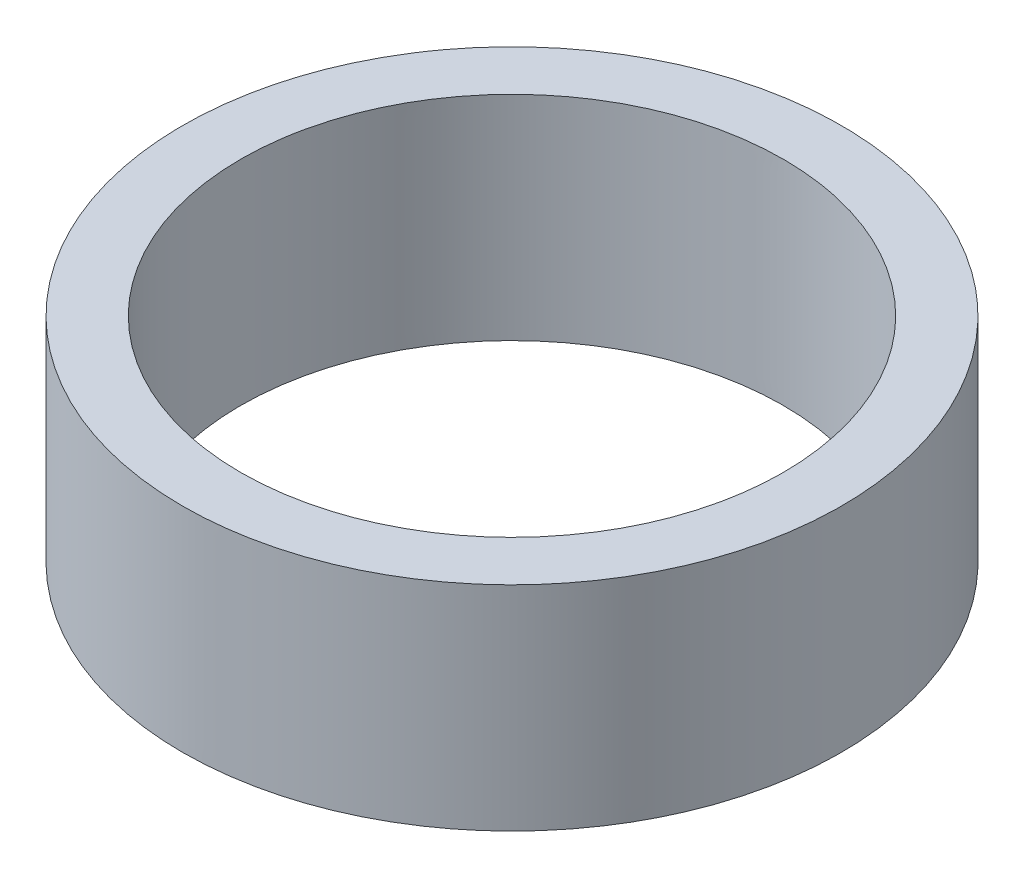
ISO-10303-21;
HEADER;
FILE_DESCRIPTION(('STEP AP214'),'2;1');
FILE_NAME('part.step','',(''),(''),'','','');
FILE_SCHEMA(('AUTOMOTIVE_DESIGN { 1 0 10303 214 1 1 1 1 }'));
ENDSEC;
DATA;
#1=APPLICATION_CONTEXT('core data for automotive mechanical design processes');
#2=APPLICATION_PROTOCOL_DEFINITION('international standard','automotive_design',2000,#1);
#3=PRODUCT_CONTEXT('',#1,'mechanical');
#4=PRODUCT('Part','Part','',(#3));
#5=PRODUCT_RELATED_PRODUCT_CATEGORY('part','',(#4));
#6=PRODUCT_DEFINITION_FORMATION('','',#4);
#7=PRODUCT_DEFINITION_CONTEXT('part definition',#1,'design');
#8=PRODUCT_DEFINITION('design','',#6,#7);
#9=PRODUCT_DEFINITION_SHAPE('','',#8);
#10=(LENGTH_UNIT() NAMED_UNIT(*) SI_UNIT(.MILLI.,.METRE.));
#11=(NAMED_UNIT(*) PLANE_ANGLE_UNIT() SI_UNIT($,.RADIAN.));
#12=(NAMED_UNIT(*) SI_UNIT($,.STERADIAN.) SOLID_ANGLE_UNIT());
#13=UNCERTAINTY_MEASURE_WITH_UNIT(LENGTH_MEASURE(1.E-05),#10,'distance_accuracy_value','');
#14=(GEOMETRIC_REPRESENTATION_CONTEXT(3) GLOBAL_UNCERTAINTY_ASSIGNED_CONTEXT((#13)) GLOBAL_UNIT_ASSIGNED_CONTEXT((#10,
#11,#12)) REPRESENTATION_CONTEXT('',''));
#15=CARTESIAN_POINT('',(0.,0.,0.));
#16=DIRECTION('',(0.,0.,1.));
#17=DIRECTION('',(1.,0.,0.));
#18=AXIS2_PLACEMENT_3D('',#15,#16,#17);
#19=CARTESIAN_POINT('',(0.,-2.7666312331574,0.846715728752538));
#20=CARTESIAN_POINT('',(-0.11081991501826,-2.7666312331574,0.846715728752538));
#21=CARTESIAN_POINT('',(-0.332459745054779,-2.7666312331574,0.802628825454349));
#22=CARTESIAN_POINT('',(-0.614305507680061,-2.7666312331574,0.614305507680062));
#23=CARTESIAN_POINT('',(-0.802628825454349,-2.7666312331574,0.332459745054779));
#24=CARTESIAN_POINT('',(-0.868759180401632,-2.7666312331574,0.));
#25=CARTESIAN_POINT('',(-0.802628825454349,-2.7666312331574,-0.332459745054779));
#26=CARTESIAN_POINT('',(-0.614305507680062,-2.7666312331574,-0.614305507680062));
#27=CARTESIAN_POINT('',(-0.332459745054779,-2.7666312331574,-0.802628825454349));
#28=CARTESIAN_POINT('',(0.,-2.7666312331574,-0.868759180401632));
#29=CARTESIAN_POINT('',(0.332459745054779,-2.7666312331574,-0.802628825454349));
#30=CARTESIAN_POINT('',(0.614305507680063,-2.7666312331574,-0.614305507680062));
#31=CARTESIAN_POINT('',(0.802628825454349,-2.7666312331574,-0.33245974505478));
#32=CARTESIAN_POINT('',(0.868759180401633,-2.7666312331574,0.));
#33=CARTESIAN_POINT('',(0.802628825454349,-2.7666312331574,0.332459745054779));
#34=CARTESIAN_POINT('',(0.614305507680062,-2.7666312331574,0.614305507680061));
#35=CARTESIAN_POINT('',(0.332459745054779,-2.7666312331574,0.802628825454349));
#36=CARTESIAN_POINT('',(0.11081991501826,-2.7666312331574,0.846715728752538));
#37=CARTESIAN_POINT('',(0.,-2.7666312331574,0.846715728752538));
#38=B_SPLINE_CURVE_WITH_KNOTS('',3,(#19,#20,#21,#22,#23,#24,#25,#26,#27,#28,#29,#30,#31,#32,#33,
#34,#35,#36,#37),.UNSPECIFIED.,.T.,.F.,(4,1,1,1,1,1,1,1,1,1,1,1,1,1,1,1,4),(0.,0.0625,0.125,
0.1875,0.25,0.3125,0.375,0.4375,0.5,0.5625,0.625,0.6875,0.75,0.8125,0.875,0.9375,1.),.UNSPECIFIED.);
#39=DIRECTION('',(0.,1.,0.));
#40=VECTOR('',#39,1.);
#41=SURFACE_OF_LINEAR_EXTRUSION('',#38,#40);
#42=CARTESIAN_POINT('',(0.,-2.7666312331574,0.846715728752538));
#43=CARTESIAN_POINT('',(-0.11081991501826,-2.7666312331574,0.846715728752538));
#44=CARTESIAN_POINT('',(-0.332459745054779,-2.7666312331574,0.802628825454349));
#45=CARTESIAN_POINT('',(-0.614305507680061,-2.7666312331574,0.614305507680062));
#46=CARTESIAN_POINT('',(-0.802628825454349,-2.7666312331574,0.332459745054779));
#47=CARTESIAN_POINT('',(-0.868759180401632,-2.7666312331574,0.));
#48=CARTESIAN_POINT('',(-0.802628825454349,-2.7666312331574,-0.332459745054779));
#49=CARTESIAN_POINT('',(-0.614305507680062,-2.7666312331574,-0.614305507680062));
#50=CARTESIAN_POINT('',(-0.332459745054779,-2.7666312331574,-0.802628825454349));
#51=CARTESIAN_POINT('',(0.,-2.7666312331574,-0.868759180401632));
#52=CARTESIAN_POINT('',(0.332459745054779,-2.7666312331574,-0.802628825454349));
#53=CARTESIAN_POINT('',(0.614305507680063,-2.7666312331574,-0.614305507680062));
#54=CARTESIAN_POINT('',(0.802628825454349,-2.7666312331574,-0.33245974505478));
#55=CARTESIAN_POINT('',(0.868759180401633,-2.7666312331574,0.));
#56=CARTESIAN_POINT('',(0.802628825454349,-2.7666312331574,0.332459745054779));
#57=CARTESIAN_POINT('',(0.614305507680062,-2.7666312331574,0.614305507680061));
#58=CARTESIAN_POINT('',(0.332459745054779,-2.7666312331574,0.802628825454349));
#59=CARTESIAN_POINT('',(0.11081991501826,-2.7666312331574,0.846715728752538));
#60=CARTESIAN_POINT('',(0.,-2.7666312331574,0.846715728752538));
#61=B_SPLINE_CURVE_WITH_KNOTS('',3,(#42,#43,#44,#45,#46,#47,#48,#49,#50,#51,#52,#53,#54,#55,#56,
#57,#58,#59,#60),.UNSPECIFIED.,.T.,.F.,(4,1,1,1,1,1,1,1,1,1,1,1,1,1,1,1,4),(0.,0.0625,0.125,
0.1875,0.25,0.3125,0.375,0.4375,0.5,0.5625,0.625,0.6875,0.75,0.8125,0.875,0.9375,1.),.UNSPECIFIED.);
#62=CARTESIAN_POINT('',(0.,-2.7666312331574,0.846715728752538));
#63=VERTEX_POINT('',#62);
#64=EDGE_CURVE('E24',#63,#63,#61,.T.);
#65=ORIENTED_EDGE('',*,*,#64,.T.);
#66=EDGE_LOOP('',(#65));
#67=FACE_BOUND('',#66,.T.);
#68=CARTESIAN_POINT('',(0.,-2.101,0.846715728752538));
#69=CARTESIAN_POINT('',(0.0138528162367135,-2.101,0.846715738781345));
#70=CARTESIAN_POINT('',(0.0277053449411908,-2.101,0.84637128476622));
#71=CARTESIAN_POINT('',(0.0553774535014129,-2.101,0.845000113335817));
#72=CARTESIAN_POINT('',(0.0691970313707356,-2.101,0.84397335578224));
#73=CARTESIAN_POINT('',(0.0967701728033148,-2.101,0.841244149887721));
#74=CARTESIAN_POINT('',(0.110523731770925,-2.101,0.839541655179026));
#75=CARTESIAN_POINT('',(0.137931969203061,-2.101,0.835467524249838));
#76=CARTESIAN_POINT('',(0.151586643376943,-2.101,0.833095859170147));
#77=CARTESIAN_POINT('',(0.178764185743274,-2.101,0.827689910322435));
#78=CARTESIAN_POINT('',(0.192287053935721,-2.101,0.824655626554413));
#79=CARTESIAN_POINT('',(0.219168071225425,-2.101,0.8179309515279));
#80=CARTESIAN_POINT('',(0.232526227402116,-2.101,0.814240588573994));
#81=CARTESIAN_POINT('',(0.259044888945606,-2.101,0.806210272097211));
#82=CARTESIAN_POINT('',(0.272205407813321,-2.101,0.801870363169988));
#83=CARTESIAN_POINT('',(0.298295907229269,-2.101,0.792547463891144));
#84=CARTESIAN_POINT('',(0.311225901294381,-2.101,0.787564511386621));
#85=CARTESIAN_POINT('',(0.336822261338679,-2.101,0.776962151913076));
#86=CARTESIAN_POINT('',(0.349488627317864,-2.101,0.771342744944053));
#87=CARTESIAN_POINT('',(0.374529681699326,-2.101,0.759486261158051));
#88=CARTESIAN_POINT('',(0.386904352897541,-2.101,0.753249148021252));
#89=CARTESIAN_POINT('',(0.411334169457727,-2.101,0.740175913943852));
#90=CARTESIAN_POINT('',(0.423389292832387,-2.101,0.733339751922784));
#91=CARTESIAN_POINT('',(0.447152106060225,-2.101,0.719087065280625));
#92=CARTESIAN_POINT('',(0.458859780904979,-2.101,0.711670515639228));
#93=CARTESIAN_POINT('',(0.481899787359842,-2.101,0.696275675508599));
#94=CARTESIAN_POINT('',(0.49323211896995,-2.101,0.688297385019367));
#95=CARTESIAN_POINT('',(0.515493519370661,-2.101,0.671797675287762));
#96=CARTESIAN_POINT('',(0.526422605533537,-2.101,0.663276279486223));
#97=CARTESIAN_POINT('',(0.547849584974473,-2.101,0.645708982072714));
#98=CARTESIAN_POINT('',(0.558347507791757,-2.101,0.636663116495185));
#99=CARTESIAN_POINT('',(0.578884267130707,-2.101,0.61806547878842));
#100=CARTESIAN_POINT('',(0.588923130623801,-2.101,0.608513736452657));
#101=CARTESIAN_POINT('',(0.608513736452658,-2.101,0.588923130623801));
#102=CARTESIAN_POINT('',(0.61806547878842,-2.101,0.578884267130707));
#103=CARTESIAN_POINT('',(0.636663116495185,-2.101,0.558347507791756));
#104=CARTESIAN_POINT('',(0.645708982072715,-2.101,0.547849584974471));
#105=CARTESIAN_POINT('',(0.663276279486224,-2.101,0.526422605533538));
#106=CARTESIAN_POINT('',(0.671797675287764,-2.101,0.515493519370666));
#107=CARTESIAN_POINT('',(0.688297385019367,-2.101,0.493232118969944));
#108=CARTESIAN_POINT('',(0.696275675508598,-2.101,0.481899787359818));
#109=CARTESIAN_POINT('',(0.71167051563923,-2.101,0.458859780905001));
#110=CARTESIAN_POINT('',(0.71908706528063,-2.101,0.447152106060309));
#111=CARTESIAN_POINT('',(0.733339751922779,-2.101,0.423389292832301));
#112=CARTESIAN_POINT('',(0.740175913943834,-2.101,0.41133416945741));
#113=CARTESIAN_POINT('',(0.753249148021272,-2.101,0.386904352897857));
#114=CARTESIAN_POINT('',(0.759486261158123,-2.101,0.374529681700507));
#115=CARTESIAN_POINT('',(0.771342744943982,-2.101,0.349488627316681));
#116=CARTESIAN_POINT('',(0.776962151912809,-2.101,0.336822261334267));
#117=CARTESIAN_POINT('',(0.787564511386888,-2.101,0.311225901298792));
#118=CARTESIAN_POINT('',(0.792547463892138,-2.101,0.298295907245731));
#119=CARTESIAN_POINT('',(0.801870363168994,-2.101,0.272205407796857));
#120=CARTESIAN_POINT('',(0.806210272093499,-2.101,0.259044888884162));
#121=CARTESIAN_POINT('',(0.814240588577706,-2.101,0.232526227463563));
#122=CARTESIAN_POINT('',(0.817930951541755,-2.101,0.21916807145476));
#123=CARTESIAN_POINT('',(0.824655626540558,-2.101,0.192287053706375));
#124=CARTESIAN_POINT('',(0.827689910270726,-2.101,0.178764184887325));
#125=CARTESIAN_POINT('',(0.833095859221857,-2.101,0.15158664423289));
#126=CARTESIAN_POINT('',(0.83546752444282,-2.101,0.137931972397505));
#127=CARTESIAN_POINT('',(0.839541654986053,-2.101,0.110523728576618));
#128=CARTESIAN_POINT('',(0.841244149167548,-2.101,0.0967701608822364));
#129=CARTESIAN_POINT('',(0.843973356502363,-2.101,0.0691970432909944));
#130=CARTESIAN_POINT('',(0.845000116023266,-2.101,0.0553774979869461));
#131=CARTESIAN_POINT('',(0.84637128207893,-2.101,0.0277053004582732));
#132=CARTESIAN_POINT('',(0.846715728752538,-2.101,0.0138526502291363));
#133=CARTESIAN_POINT('',(0.846715728752538,-2.101,-0.0138526502291377));
#134=CARTESIAN_POINT('',(0.84637128207893,-2.101,-0.0277053004582747));
#135=CARTESIAN_POINT('',(0.845000116023266,-2.101,-0.0553774979869475));
#136=CARTESIAN_POINT('',(0.843973356502363,-2.101,-0.0691970432909958));
#137=CARTESIAN_POINT('',(0.841244149167548,-2.101,-0.0967701608822379));
#138=CARTESIAN_POINT('',(0.839541654986053,-2.101,-0.110523728576619));
#139=CARTESIAN_POINT('',(0.835467524442819,-2.101,-0.137931972397506));
#140=CARTESIAN_POINT('',(0.833095859221857,-2.101,-0.151586644232892));
#141=CARTESIAN_POINT('',(0.827689910270726,-2.101,-0.178764184887327));
#142=CARTESIAN_POINT('',(0.824655626540558,-2.101,-0.192287053706377));
#143=CARTESIAN_POINT('',(0.817930951541754,-2.101,-0.219168071454761));
#144=CARTESIAN_POINT('',(0.814240588577706,-2.101,-0.232526227463565));
#145=CARTESIAN_POINT('',(0.806210272093499,-2.101,-0.259044888884163));
#146=CARTESIAN_POINT('',(0.801870363168993,-2.101,-0.272205407796858));
#147=CARTESIAN_POINT('',(0.792547463892138,-2.101,-0.298295907245733));
#148=CARTESIAN_POINT('',(0.787564511386887,-2.101,-0.311225901298793));
#149=CARTESIAN_POINT('',(0.776962151912809,-2.101,-0.336822261334268));
#150=CARTESIAN_POINT('',(0.771342744943981,-2.101,-0.349488627316682));
#151=CARTESIAN_POINT('',(0.759486261158122,-2.101,-0.374529681700509));
#152=CARTESIAN_POINT('',(0.753249148021271,-2.101,-0.386904352897859));
#153=CARTESIAN_POINT('',(0.740175913943833,-2.101,-0.411334169457411));
#154=CARTESIAN_POINT('',(0.733339751922778,-2.101,-0.423389292832302));
#155=CARTESIAN_POINT('',(0.71908706528063,-2.101,-0.44715210606031));
#156=CARTESIAN_POINT('',(0.711670515639229,-2.101,-0.458859780905002));
#157=CARTESIAN_POINT('',(0.696275675508598,-2.101,-0.481899787359819));
#158=CARTESIAN_POINT('',(0.688297385019367,-2.101,-0.493232118969945));
#159=CARTESIAN_POINT('',(0.671797675287763,-2.101,-0.515493519370667));
#160=CARTESIAN_POINT('',(0.663276279486224,-2.101,-0.526422605533539));
#161=CARTESIAN_POINT('',(0.645708982072715,-2.101,-0.547849584974472));
#162=CARTESIAN_POINT('',(0.636663116495185,-2.101,-0.558347507791757));
#163=CARTESIAN_POINT('',(0.61806547878842,-2.101,-0.578884267130708));
#164=CARTESIAN_POINT('',(0.608513736452657,-2.101,-0.588923130623802));
#165=CARTESIAN_POINT('',(0.588923130623801,-2.101,-0.608513736452658));
#166=CARTESIAN_POINT('',(0.578884267130707,-2.101,-0.61806547878842));
#167=CARTESIAN_POINT('',(0.558347507791756,-2.101,-0.636663116495186));
#168=CARTESIAN_POINT('',(0.547849584974471,-2.101,-0.645708982072715));
#169=CARTESIAN_POINT('',(0.526422605533538,-2.101,-0.663276279486224));
#170=CARTESIAN_POINT('',(0.515493519370667,-2.101,-0.671797675287764));
#171=CARTESIAN_POINT('',(0.493232118969944,-2.101,-0.688297385019368));
#172=CARTESIAN_POINT('',(0.481899787359818,-2.101,-0.696275675508598));
#173=CARTESIAN_POINT('',(0.458859780905001,-2.101,-0.71167051563923));
#174=CARTESIAN_POINT('',(0.447152106060309,-2.101,-0.719087065280631));
#175=CARTESIAN_POINT('',(0.423389292832301,-2.101,-0.733339751922779));
#176=CARTESIAN_POINT('',(0.41133416945741,-2.101,-0.740175913943834));
#177=CARTESIAN_POINT('',(0.386904352897857,-2.101,-0.753249148021272));
#178=CARTESIAN_POINT('',(0.374529681700507,-2.101,-0.759486261158123));
#179=CARTESIAN_POINT('',(0.349488627316681,-2.101,-0.771342744943982));
#180=CARTESIAN_POINT('',(0.336822261334266,-2.101,-0.77696215191281));
#181=CARTESIAN_POINT('',(0.311225901298792,-2.101,-0.787564511386888));
#182=CARTESIAN_POINT('',(0.298295907245731,-2.101,-0.792547463892139));
#183=CARTESIAN_POINT('',(0.272205407796857,-2.101,-0.801870363168994));
#184=CARTESIAN_POINT('',(0.259044888884162,-2.101,-0.806210272093499));
#185=CARTESIAN_POINT('',(0.232526227463563,-2.101,-0.814240588577706));
#186=CARTESIAN_POINT('',(0.219168071454759,-2.101,-0.817930951541755));
#187=CARTESIAN_POINT('',(0.192287053706375,-2.101,-0.824655626540558));
#188=CARTESIAN_POINT('',(0.178764184887325,-2.101,-0.827689910270726));
#189=CARTESIAN_POINT('',(0.15158664423289,-2.101,-0.833095859221857));
#190=CARTESIAN_POINT('',(0.137931972397505,-2.101,-0.83546752444282));
#191=CARTESIAN_POINT('',(0.110523728576618,-2.101,-0.839541654986053));
#192=CARTESIAN_POINT('',(0.0967701608822364,-2.101,-0.841244149167548));
#193=CARTESIAN_POINT('',(0.0691970432909944,-2.101,-0.843973356502363));
#194=CARTESIAN_POINT('',(0.0553774979869461,-2.101,-0.845000116023266));
#195=CARTESIAN_POINT('',(0.0277053004582733,-2.101,-0.84637128207893));
#196=CARTESIAN_POINT('',(0.0138526502291364,-2.101,-0.846715728752538));
#197=CARTESIAN_POINT('',(-0.0138526502291375,-2.101,-0.846715728752538));
#198=CARTESIAN_POINT('',(-0.0277053004582745,-2.101,-0.84637128207893));
#199=CARTESIAN_POINT('',(-0.0553774979869473,-2.101,-0.845000116023266));
#200=CARTESIAN_POINT('',(-0.0691970432909956,-2.101,-0.843973356502363));
#201=CARTESIAN_POINT('',(-0.0967701608822376,-2.101,-0.841244149167548));
#202=CARTESIAN_POINT('',(-0.110523728576619,-2.101,-0.839541654986053));
#203=CARTESIAN_POINT('',(-0.137931972397506,-2.101,-0.835467524442819));
#204=CARTESIAN_POINT('',(-0.151586644232891,-2.101,-0.833095859221857));
#205=CARTESIAN_POINT('',(-0.178764184887326,-2.101,-0.827689910270726));
#206=CARTESIAN_POINT('',(-0.192287053706376,-2.101,-0.824655626540558));
#207=CARTESIAN_POINT('',(-0.219168071454761,-2.101,-0.817930951541754));
#208=CARTESIAN_POINT('',(-0.232526227463564,-2.101,-0.814240588577706));
#209=CARTESIAN_POINT('',(-0.259044888884163,-2.101,-0.806210272093499));
#210=CARTESIAN_POINT('',(-0.272205407796858,-2.101,-0.801870363168994));
#211=CARTESIAN_POINT('',(-0.298295907245732,-2.101,-0.792547463892138));
#212=CARTESIAN_POINT('',(-0.311225901298793,-2.101,-0.787564511386888));
#213=CARTESIAN_POINT('',(-0.336822261334267,-2.101,-0.776962151912809));
#214=CARTESIAN_POINT('',(-0.349488627316682,-2.101,-0.771342744943982));
#215=CARTESIAN_POINT('',(-0.374529681700508,-2.101,-0.759486261158123));
#216=CARTESIAN_POINT('',(-0.386904352897858,-2.101,-0.753249148021271));
#217=CARTESIAN_POINT('',(-0.41133416945741,-2.101,-0.740175913943833));
#218=CARTESIAN_POINT('',(-0.423389292832302,-2.101,-0.733339751922779));
#219=CARTESIAN_POINT('',(-0.44715210606031,-2.101,-0.71908706528063));
#220=CARTESIAN_POINT('',(-0.458859780905002,-2.101,-0.711670515639229));
#221=CARTESIAN_POINT('',(-0.481899787359819,-2.101,-0.696275675508598));
#222=CARTESIAN_POINT('',(-0.493232118969944,-2.101,-0.688297385019367));
#223=CARTESIAN_POINT('',(-0.515493519370667,-2.101,-0.671797675287763));
#224=CARTESIAN_POINT('',(-0.526422605533538,-2.101,-0.663276279486224));
#225=CARTESIAN_POINT('',(-0.547849584974471,-2.101,-0.645708982072714));
#226=CARTESIAN_POINT('',(-0.558347507791757,-2.101,-0.636663116495185));
#227=CARTESIAN_POINT('',(-0.578884267130707,-2.101,-0.61806547878842));
#228=CARTESIAN_POINT('',(-0.588923130623801,-2.101,-0.608513736452657));
#229=CARTESIAN_POINT('',(-0.608513736452657,-2.101,-0.588923130623801));
#230=CARTESIAN_POINT('',(-0.61806547878842,-2.101,-0.578884267130707));
#231=CARTESIAN_POINT('',(-0.636663116495185,-2.101,-0.558347507791756));
#232=CARTESIAN_POINT('',(-0.645708982072714,-2.101,-0.547849584974471));
#233=CARTESIAN_POINT('',(-0.663276279486224,-2.101,-0.526422605533538));
#234=CARTESIAN_POINT('',(-0.671797675287763,-2.101,-0.515493519370667));
#235=CARTESIAN_POINT('',(-0.688297385019367,-2.101,-0.493232118969944));
#236=CARTESIAN_POINT('',(-0.696275675508598,-2.101,-0.481899787359819));
#237=CARTESIAN_POINT('',(-0.711670515639229,-2.101,-0.458859780905001));
#238=CARTESIAN_POINT('',(-0.71908706528063,-2.101,-0.447152106060309));
#239=CARTESIAN_POINT('',(-0.733339751922779,-2.101,-0.423389292832301));
#240=CARTESIAN_POINT('',(-0.740175913943834,-2.101,-0.41133416945741));
#241=CARTESIAN_POINT('',(-0.753249148021272,-2.101,-0.386904352897858));
#242=CARTESIAN_POINT('',(-0.759486261158122,-2.101,-0.374529681700507));
#243=CARTESIAN_POINT('',(-0.771342744943982,-2.101,-0.349488627316681));
#244=CARTESIAN_POINT('',(-0.776962151912809,-2.101,-0.336822261334267));
#245=CARTESIAN_POINT('',(-0.787564511386888,-2.101,-0.311225901298792));
#246=CARTESIAN_POINT('',(-0.792547463892138,-2.101,-0.298295907245732));
#247=CARTESIAN_POINT('',(-0.801870363168994,-2.101,-0.272205407796857));
#248=CARTESIAN_POINT('',(-0.806210272093499,-2.101,-0.259044888884162));
#249=CARTESIAN_POINT('',(-0.814240588577706,-2.101,-0.232526227463564));
#250=CARTESIAN_POINT('',(-0.817930951541754,-2.101,-0.21916807145476));
#251=CARTESIAN_POINT('',(-0.824655626540558,-2.101,-0.192287053706376));
#252=CARTESIAN_POINT('',(-0.827689910270726,-2.101,-0.178764184887326));
#253=CARTESIAN_POINT('',(-0.833095859221857,-2.101,-0.151586644232891));
#254=CARTESIAN_POINT('',(-0.83546752444282,-2.101,-0.137931972397505));
#255=CARTESIAN_POINT('',(-0.839541654986053,-2.101,-0.110523728576618));
#256=CARTESIAN_POINT('',(-0.841244149167548,-2.101,-0.096770160882237));
#257=CARTESIAN_POINT('',(-0.843973356502363,-2.101,-0.069197043290995));
#258=CARTESIAN_POINT('',(-0.845000116023266,-2.101,-0.0553774979869467));
#259=CARTESIAN_POINT('',(-0.84637128207893,-2.101,-0.0277053004582739));
#260=CARTESIAN_POINT('',(-0.846715728752538,-2.101,-0.013852650229137));
#261=CARTESIAN_POINT('',(-0.846715728752538,-2.101,0.013852650229137));
#262=CARTESIAN_POINT('',(-0.84637128207893,-2.101,0.0277053004582739));
#263=CARTESIAN_POINT('',(-0.845000116023266,-2.101,0.0553774979869467));
#264=CARTESIAN_POINT('',(-0.843973356502363,-2.101,0.069197043290995));
#265=CARTESIAN_POINT('',(-0.841244149167548,-2.101,0.096770160882237));
#266=CARTESIAN_POINT('',(-0.839541654986053,-2.101,0.110523728576618));
#267=CARTESIAN_POINT('',(-0.835467524442819,-2.101,0.137931972397505));
#268=CARTESIAN_POINT('',(-0.833095859221856,-2.101,0.151586644232891));
#269=CARTESIAN_POINT('',(-0.827689910270726,-2.101,0.178764184887326));
#270=CARTESIAN_POINT('',(-0.824655626540558,-2.101,0.192287053706376));
#271=CARTESIAN_POINT('',(-0.817930951541754,-2.101,0.21916807145476));
#272=CARTESIAN_POINT('',(-0.814240588577706,-2.101,0.232526227463564));
#273=CARTESIAN_POINT('',(-0.806210272093499,-2.101,0.259044888884162));
#274=CARTESIAN_POINT('',(-0.801870363168994,-2.101,0.272205407796857));
#275=CARTESIAN_POINT('',(-0.792547463892138,-2.101,0.298295907245732));
#276=CARTESIAN_POINT('',(-0.787564511386888,-2.101,0.311225901298792));
#277=CARTESIAN_POINT('',(-0.776962151912809,-2.101,0.336822261334267));
#278=CARTESIAN_POINT('',(-0.771342744943982,-2.101,0.349488627316681));
#279=CARTESIAN_POINT('',(-0.759486261158122,-2.101,0.374529681700508));
#280=CARTESIAN_POINT('',(-0.753249148021272,-2.101,0.386904352897858));
#281=CARTESIAN_POINT('',(-0.740175913943834,-2.101,0.41133416945741));
#282=CARTESIAN_POINT('',(-0.733339751922779,-2.101,0.423389292832301));
#283=CARTESIAN_POINT('',(-0.71908706528063,-2.101,0.447152106060309));
#284=CARTESIAN_POINT('',(-0.71167051563923,-2.101,0.458859780905002));
#285=CARTESIAN_POINT('',(-0.696275675508598,-2.101,0.481899787359819));
#286=CARTESIAN_POINT('',(-0.688297385019367,-2.101,0.493232118969944));
#287=CARTESIAN_POINT('',(-0.671797675287763,-2.101,0.515493519370667));
#288=CARTESIAN_POINT('',(-0.663276279486224,-2.101,0.526422605533538));
#289=CARTESIAN_POINT('',(-0.645708982072714,-2.101,0.547849584974471));
#290=CARTESIAN_POINT('',(-0.636663116495185,-2.101,0.558347507791756));
#291=CARTESIAN_POINT('',(-0.61806547878842,-2.101,0.578884267130707));
#292=CARTESIAN_POINT('',(-0.608513736452657,-2.101,0.588923130623801));
#293=CARTESIAN_POINT('',(-0.588923130623801,-2.101,0.608513736452657));
#294=CARTESIAN_POINT('',(-0.578884267130707,-2.101,0.61806547878842));
#295=CARTESIAN_POINT('',(-0.558347507791757,-2.101,0.636663116495185));
#296=CARTESIAN_POINT('',(-0.547849584974473,-2.101,0.645708982072714));
#297=CARTESIAN_POINT('',(-0.526422605533536,-2.101,0.663276279486224));
#298=CARTESIAN_POINT('',(-0.51549351937066,-2.101,0.671797675287763));
#299=CARTESIAN_POINT('',(-0.49323211896995,-2.101,0.688297385019367));
#300=CARTESIAN_POINT('',(-0.481899787359841,-2.101,0.696275675508599));
#301=CARTESIAN_POINT('',(-0.458859780904979,-2.101,0.711670515639228));
#302=CARTESIAN_POINT('',(-0.447152106060225,-2.101,0.719087065280625));
#303=CARTESIAN_POINT('',(-0.423389292832386,-2.101,0.733339751922784));
#304=CARTESIAN_POINT('',(-0.411334169457727,-2.101,0.740175913943853));
#305=CARTESIAN_POINT('',(-0.386904352897541,-2.101,0.753249148021252));
#306=CARTESIAN_POINT('',(-0.374529681699325,-2.101,0.759486261158051));
#307=CARTESIAN_POINT('',(-0.349488627317863,-2.101,0.771342744944053));
#308=CARTESIAN_POINT('',(-0.336822261338678,-2.101,0.776962151913076));
#309=CARTESIAN_POINT('',(-0.311225901294381,-2.101,0.787564511386621));
#310=CARTESIAN_POINT('',(-0.298295907229269,-2.101,0.792547463891144));
#311=CARTESIAN_POINT('',(-0.272205407813321,-2.101,0.801870363169988));
#312=CARTESIAN_POINT('',(-0.259044888945606,-2.101,0.806210272097211));
#313=CARTESIAN_POINT('',(-0.232526227402116,-2.101,0.814240588573994));
#314=CARTESIAN_POINT('',(-0.219168071225425,-2.101,0.8179309515279));
#315=CARTESIAN_POINT('',(-0.192287053935721,-2.101,0.824655626554413));
#316=CARTESIAN_POINT('',(-0.178764185743273,-2.101,0.827689910322435));
#317=CARTESIAN_POINT('',(-0.151586643376943,-2.101,0.833095859170147));
#318=CARTESIAN_POINT('',(-0.137931969203061,-2.101,0.835467524249838));
#319=CARTESIAN_POINT('',(-0.110523731770925,-2.101,0.839541655179027));
#320=CARTESIAN_POINT('',(-0.0967701728033147,-2.101,0.841244149887721));
#321=CARTESIAN_POINT('',(-0.0691970313707355,-2.101,0.84397335578224));
#322=CARTESIAN_POINT('',(-0.0553774535014128,-2.101,0.845000113335817));
#323=CARTESIAN_POINT('',(-0.0277053449411908,-2.101,0.84637128476622));
#324=CARTESIAN_POINT('',(-0.0138528162367135,-2.101,0.846715738781345));
#325=CARTESIAN_POINT('',(0.,-2.101,0.846715728752538));
#326=B_SPLINE_CURVE_WITH_KNOTS('',3,(#68,#69,#70,#71,#72,#73,#74,#75,#76,#77,#78,#79,#80,#81,
#82,#83,#84,#85,#86,#87,#88,#89,#90,#91,#92,#93,#94,#95,#96,#97,#98,#99,#100,#101,#102,#103,
#104,#105,#106,#107,#108,#109,#110,#111,#112,#113,#114,#115,#116,#117,#118,#119,#120,#121,#122,
#123,#124,#125,#126,#127,#128,#129,#130,#131,#132,#133,#134,#135,#136,#137,#138,#139,#140,#141,
#142,#143,#144,#145,#146,#147,#148,#149,#150,#151,#152,#153,#154,#155,#156,#157,#158,#159,#160,
#161,#162,#163,#164,#165,#166,#167,#168,#169,#170,#171,#172,#173,#174,#175,#176,#177,#178,#179,
#180,#181,#182,#183,#184,#185,#186,#187,#188,#189,#190,#191,#192,#193,#194,#195,#196,#197,#198,
#199,#200,#201,#202,#203,#204,#205,#206,#207,#208,#209,#210,#211,#212,#213,#214,#215,#216,#217,
#218,#219,#220,#221,#222,#223,#224,#225,#226,#227,#228,#229,#230,#231,#232,#233,#234,#235,#236,
#237,#238,#239,#240,#241,#242,#243,#244,#245,#246,#247,#248,#249,#250,#251,#252,#253,#254,#255,
#256,#257,#258,#259,#260,#261,#262,#263,#264,#265,#266,#267,#268,#269,#270,#271,#272,#273,#274,
#275,#276,#277,#278,#279,#280,#281,#282,#283,#284,#285,#286,#287,#288,#289,#290,#291,#292,#293,
#294,#295,#296,#297,#298,#299,#300,#301,#302,#303,#304,#305,#306,#307,#308,#309,#310,#311,#312,
#313,#314,#315,#316,#317,#318,#319,#320,#321,#322,#323,#324,#325),.UNSPECIFIED.,.F.,.F.,(4,2,2,
2,2,2,2,2,2,2,2,2,2,2,2,2,2,2,2,2,2,2,2,2,2,2,2,2,2,2,2,2,2,2,2,2,2,2,2,2,2,2,2,2,2,2,2,2,2,2,2,
2,2,2,2,2,2,2,2,2,2,2,2,2,2,2,2,2,2,2,2,2,2,2,2,2,2,2,2,2,2,2,2,2,2,2,2,2,2,2,2,2,2,2,2,2,2,2,2,
2,2,2,2,2,2,2,2,2,2,2,2,2,2,2,2,2,2,2,2,2,2,2,2,2,2,2,2,2,4),(0.,0.0415537598151005,
0.0831099643557935,0.124669020894582,0.166229870017717,0.207790719140851,0.24934977567964,
0.290905980220333,0.332459740035433,0.374013499850534,0.415569704391227,0.457128760930015,
0.49868961005315,0.540250459176284,0.581809515715073,0.623365720255766,0.664919480070866,
0.706473239885967,0.74802944442666,0.789588500965448,0.831149350088583,0.872710199211717,
0.914269255750506,0.955825460291199,0.997379220106299,1.0389329799214,1.08048918446209,
1.12204824100088,1.16360909012402,1.20516993924715,1.24672899578594,1.28828520032663,
1.32983896014173,1.37139271995683,1.41294892449753,1.45450798103632,1.49606883015945,
1.53762967928258,1.57918873582137,1.62074494036207,1.66229870017717,1.70385245999227,
1.74540866453296,1.78696772107175,1.82852857019488,1.87008941931802,1.91164847585681,
1.9532046803975,1.9947584402126,2.0363122000277,2.07786840456839,2.11942746110718,
2.16098831023031,2.20254915935345,2.24410821589224,2.28566442043293,2.32721818024803,
2.36877194006313,2.41032814460382,2.45188720114261,2.49344805026575,2.53500889938888,
2.57656795592767,2.61812416046836,2.65967792028346,2.70123168009856,2.74278788463926,
2.78434694117805,2.82590779030118,2.86746863942431,2.9090276959631,2.9505839005038,
2.9921376603189,3.033691420134,3.07524762467469,3.11680668121348,3.15836753033661,
3.19992837945975,3.24148743599853,3.28304364053923,3.32459740035433,3.36615116016943,
3.40770736471012,3.44926642124891,3.49082727037204,3.53238811949518,3.57394717603397,
3.61550338057466,3.65705714038976,3.69861090020486,3.74016710474555,3.78172616128434,
3.82328701040748,3.86484785953061,3.9064069160694,3.94796312061009,3.98951688042519,
4.03107064024029,4.07262684478099,4.11418590131978,4.15574675044291,4.19730759956604,
4.23886665610483,4.28042286064553,4.32197662046063,4.36353038027573,4.40508658481642,
4.44664564135521,4.48820649047834,4.52976733960148,4.57132639614026,4.61288260068096,
4.65443636049606,4.69599012031116,4.73754632485185,4.77910538139064,4.82066623051377,
4.86222707963691,4.9037861361757,4.94534234071639,4.98689610053149,5.02844986034659,
5.07000606488728,5.11156512142607,5.1531259705492,5.19468681967234,5.23624587621113,
5.27780208075182,5.31935584056692),.UNSPECIFIED.);
#327=CARTESIAN_POINT('',(0.,-2.101,0.846715728752538));
#328=VERTEX_POINT('',#327);
#329=EDGE_CURVE('E34',#328,#328,#326,.F.);
#330=ORIENTED_EDGE('',*,*,#329,.F.);
#331=EDGE_LOOP('',(#330));
#332=FACE_BOUND('',#331,.T.);
#333=ADVANCED_FACE('F14',(#67,#332),#41,.T.);
#334=CARTESIAN_POINT('',(0.,-2.7666312331574,1.02828427124746));
#335=CARTESIAN_POINT('',(0.134583983366112,-2.7666312331574,1.02828427124746));
#336=CARTESIAN_POINT('',(0.403751950098335,-2.7666312331574,0.974743433761986));
#337=CARTESIAN_POINT('',(0.746036325814741,-2.7666312331574,0.746036325814741));
#338=CARTESIAN_POINT('',(0.974743433761986,-2.7666312331574,0.403751950098335));
#339=CARTESIAN_POINT('',(1.0550546899902,-2.7666312331574,0.));
#340=CARTESIAN_POINT('',(0.974743433761986,-2.7666312331574,-0.403751950098336));
#341=CARTESIAN_POINT('',(0.746036325814741,-2.7666312331574,-0.746036325814741));
#342=CARTESIAN_POINT('',(0.403751950098335,-2.7666312331574,-0.974743433761986));
#343=CARTESIAN_POINT('',(0.,-2.7666312331574,-1.0550546899902));
#344=CARTESIAN_POINT('',(-0.403751950098335,-2.7666312331574,-0.974743433761986));
#345=CARTESIAN_POINT('',(-0.746036325814741,-2.7666312331574,-0.746036325814741));
#346=CARTESIAN_POINT('',(-0.974743433761986,-2.7666312331574,-0.403751950098336));
#347=CARTESIAN_POINT('',(-1.0550546899902,-2.7666312331574,0.));
#348=CARTESIAN_POINT('',(-0.974743433761986,-2.7666312331574,0.403751950098335));
#349=CARTESIAN_POINT('',(-0.746036325814741,-2.7666312331574,0.746036325814741));
#350=CARTESIAN_POINT('',(-0.403751950098336,-2.7666312331574,0.974743433761986));
#351=CARTESIAN_POINT('',(-0.134583983366112,-2.7666312331574,1.02828427124746));
#352=CARTESIAN_POINT('',(0.,-2.7666312331574,1.02828427124746));
#353=B_SPLINE_CURVE_WITH_KNOTS('',3,(#334,#335,#336,#337,#338,#339,#340,#341,#342,#343,#344,
#345,#346,#347,#348,#349,#350,#351,#352),.UNSPECIFIED.,.T.,.F.,(4,1,1,1,1,1,1,1,1,1,1,1,1,1,1,1,
4),(0.,0.0625,0.125,0.1875,0.25,0.3125,0.375,0.4375,0.5,0.5625,0.625,0.6875,0.75,0.8125,0.875,
0.9375,1.),.UNSPECIFIED.);
#354=DIRECTION('',(0.,1.,0.));
#355=VECTOR('',#354,1.);
#356=SURFACE_OF_LINEAR_EXTRUSION('',#353,#355);
#357=CARTESIAN_POINT('',(0.,-2.7666312331574,1.02828427124746));
#358=CARTESIAN_POINT('',(0.134583983366112,-2.7666312331574,1.02828427124746));
#359=CARTESIAN_POINT('',(0.403751950098335,-2.7666312331574,0.974743433761986));
#360=CARTESIAN_POINT('',(0.746036325814741,-2.7666312331574,0.746036325814741));
#361=CARTESIAN_POINT('',(0.974743433761986,-2.7666312331574,0.403751950098335));
#362=CARTESIAN_POINT('',(1.0550546899902,-2.7666312331574,0.));
#363=CARTESIAN_POINT('',(0.974743433761986,-2.7666312331574,-0.403751950098336));
#364=CARTESIAN_POINT('',(0.746036325814741,-2.7666312331574,-0.746036325814741));
#365=CARTESIAN_POINT('',(0.403751950098335,-2.7666312331574,-0.974743433761986));
#366=CARTESIAN_POINT('',(0.,-2.7666312331574,-1.0550546899902));
#367=CARTESIAN_POINT('',(-0.403751950098335,-2.7666312331574,-0.974743433761986));
#368=CARTESIAN_POINT('',(-0.746036325814741,-2.7666312331574,-0.746036325814741));
#369=CARTESIAN_POINT('',(-0.974743433761986,-2.7666312331574,-0.403751950098336));
#370=CARTESIAN_POINT('',(-1.0550546899902,-2.7666312331574,0.));
#371=CARTESIAN_POINT('',(-0.974743433761986,-2.7666312331574,0.403751950098335));
#372=CARTESIAN_POINT('',(-0.746036325814741,-2.7666312331574,0.746036325814741));
#373=CARTESIAN_POINT('',(-0.403751950098336,-2.7666312331574,0.974743433761986));
#374=CARTESIAN_POINT('',(-0.134583983366112,-2.7666312331574,1.02828427124746));
#375=CARTESIAN_POINT('',(0.,-2.7666312331574,1.02828427124746));
#376=B_SPLINE_CURVE_WITH_KNOTS('',3,(#357,#358,#359,#360,#361,#362,#363,#364,#365,#366,#367,
#368,#369,#370,#371,#372,#373,#374,#375),.UNSPECIFIED.,.T.,.F.,(4,1,1,1,1,1,1,1,1,1,1,1,1,1,1,1,
4),(0.,0.0625,0.125,0.1875,0.25,0.3125,0.375,0.4375,0.5,0.5625,0.625,0.6875,0.75,0.8125,0.875,
0.9375,1.),.UNSPECIFIED.);
#377=CARTESIAN_POINT('',(0.,-2.7666312331574,1.02828427124746));
#378=VERTEX_POINT('',#377);
#379=EDGE_CURVE('E9',#378,#378,#376,.T.);
#380=ORIENTED_EDGE('',*,*,#379,.T.);
#381=EDGE_LOOP('',(#380));
#382=FACE_BOUND('',#381,.T.);
#383=CARTESIAN_POINT('',(0.,-2.101,1.02828427124746));
#384=CARTESIAN_POINT('',(-0.0168233948714765,-2.101,1.02828428342683));
#385=CARTESIAN_POINT('',(-0.0336464405527043,-2.101,1.02786596517208));
#386=CARTESIAN_POINT('',(-0.0672525175611601,-2.101,1.02620076164841));
#387=CARTESIAN_POINT('',(-0.0840355464760005,-2.101,1.02495382763399));
#388=CARTESIAN_POINT('',(-0.117521433983695,-2.101,1.0216393746257));
#389=CARTESIAN_POINT('',(-0.134224286995419,-2.101,1.01957179932104));
#390=CARTESIAN_POINT('',(-0.167509908718312,-2.101,1.01462401742539));
#391=CARTESIAN_POINT('',(-0.184092672218759,-2.101,1.01174377578667));
#392=CARTESIAN_POINT('',(-0.217098128946996,-2.101,1.00517858279154));
#393=CARTESIAN_POINT('',(-0.233520822174785,-2.101,1.00149363143513));
#394=CARTESIAN_POINT('',(-0.266166167401638,-2.101,0.9933269264547));
#395=CARTESIAN_POINT('',(-0.282388827998241,-2.101,0.988845207204856));
#396=CARTESIAN_POINT('',(-0.314594114416956,-2.101,0.979092880838625));
#397=CARTESIAN_POINT('',(-0.3305767566351,-2.101,0.973822327880923));
#398=CARTESIAN_POINT('',(-0.362262066435518,-2.101,0.962500239055452));
#399=CARTESIAN_POINT('',(-0.377964750433211,-2.101,0.956448749150661));
#400=CARTESIAN_POINT('',(-0.409049958302817,-2.101,0.943572834466968));
#401=CARTESIAN_POINT('',(-0.42443248217473,-2.101,0.936748409688067));
#402=CARTESIAN_POINT('',(-0.454843305407984,-2.101,0.922349438019726));
#403=CARTESIAN_POINT('',(-0.46987158387605,-2.101,0.914774847022095));
#404=CARTESIAN_POINT('',(-0.499540096300297,-2.101,0.898898206823227));
#405=CARTESIAN_POINT('',(-0.514180303554238,-2.101,0.890596107732284));
#406=CARTESIAN_POINT('',(-0.543038781379822,-2.101,0.87328709480212));
#407=CARTESIAN_POINT('',(-0.557257033724652,-2.101,0.864280150577273));
#408=CARTESIAN_POINT('',(-0.585237707098796,-2.101,0.845584062354113));
#409=CARTESIAN_POINT('',(-0.59900012812811,-2.101,0.8358949183558));
#410=CARTESIAN_POINT('',(-0.62603523224944,-2.101,0.815857033832083));
#411=CARTESIAN_POINT('',(-0.639307936439016,-2.101,0.805508321774134));
#412=CARTESIAN_POINT('',(-0.665329687531225,-2.101,0.784173917551773));
#413=CARTESIAN_POINT('',(-0.678078770307433,-2.101,0.773188269148977));
#414=CARTESIAN_POINT('',(-0.70301940373791,-2.101,0.750602579894804));
#415=CARTESIAN_POINT('',(-0.715210987147324,-2.101,0.739002575225771));
#416=CARTESIAN_POINT('',(-0.73900257522577,-2.101,0.715210987147325));
#417=CARTESIAN_POINT('',(-0.750602579894803,-2.101,0.703019403737912));
#418=CARTESIAN_POINT('',(-0.773188269148977,-2.101,0.678078770307433));
#419=CARTESIAN_POINT('',(-0.784173917551772,-2.101,0.665329687531224));
#420=CARTESIAN_POINT('',(-0.805508321774134,-2.101,0.639307936439018));
#421=CARTESIAN_POINT('',(-0.815857033832083,-2.101,0.626035232249448));
#422=CARTESIAN_POINT('',(-0.835894918355799,-2.101,0.599000128128103));
#423=CARTESIAN_POINT('',(-0.845584062354111,-2.101,0.585237707098768));
#424=CARTESIAN_POINT('',(-0.864280150577274,-2.101,0.55725703372468));
#425=CARTESIAN_POINT('',(-0.873287094802126,-2.101,0.543038781379925));
#426=CARTESIAN_POINT('',(-0.890596107732277,-2.101,0.514180303554136));
#427=CARTESIAN_POINT('',(-0.898898206823204,-2.101,0.499540096299912));
#428=CARTESIAN_POINT('',(-0.914774847022119,-2.101,0.469871583876435));
#429=CARTESIAN_POINT('',(-0.922349438019812,-2.101,0.45484330540942));
#430=CARTESIAN_POINT('',(-0.93674840968798,-2.101,0.424432482173294));
#431=CARTESIAN_POINT('',(-0.943572834466644,-2.101,0.40904995829746));
#432=CARTESIAN_POINT('',(-0.956448749150984,-2.101,0.377964750438568));
#433=CARTESIAN_POINT('',(-0.96250023905666,-2.101,0.36226206645551));
#434=CARTESIAN_POINT('',(-0.973822327879715,-2.101,0.330576756615106));
#435=CARTESIAN_POINT('',(-0.979092880834117,-2.101,0.314594114342337));
#436=CARTESIAN_POINT('',(-0.988845207209364,-2.101,0.282388828072867));
#437=CARTESIAN_POINT('',(-0.993326926471525,-2.101,0.266166167680152));
#438=CARTESIAN_POINT('',(-1.00149363141831,-2.101,0.233520821896259));
#439=CARTESIAN_POINT('',(-1.00517858272874,-2.101,0.2170981279075));
#440=CARTESIAN_POINT('',(-1.01174377584947,-2.101,0.184092673258255));
#441=CARTESIAN_POINT('',(-1.01462401765975,-2.101,0.167509912597769));
#442=CARTESIAN_POINT('',(-1.01957179908669,-2.101,0.134224283116129));
#443=CARTESIAN_POINT('',(-1.02163937375109,-2.101,0.117521419506278));
#444=CARTESIAN_POINT('',(-1.02495382850853,-2.101,0.0840355609524243));
#445=CARTESIAN_POINT('',(-1.02620076491215,-2.101,0.0672525715861103));
#446=CARTESIAN_POINT('',(-1.02786596190853,-2.101,0.0336463865309331));
#447=CARTESIAN_POINT('',(-1.02828427124746,-2.101,0.0168231932654668));
#448=CARTESIAN_POINT('',(-1.02828427124746,-2.101,-0.0168231932654658));
#449=CARTESIAN_POINT('',(-1.02786596190853,-2.101,-0.0336463865309321));
#450=CARTESIAN_POINT('',(-1.02620076491215,-2.101,-0.0672525715861094));
#451=CARTESIAN_POINT('',(-1.02495382850853,-2.101,-0.0840355609524233));
#452=CARTESIAN_POINT('',(-1.02163937375109,-2.101,-0.117521419506277));
#453=CARTESIAN_POINT('',(-1.01957179908669,-2.101,-0.134224283116129));
#454=CARTESIAN_POINT('',(-1.01462401765975,-2.101,-0.167509912597768));
#455=CARTESIAN_POINT('',(-1.01174377584947,-2.101,-0.184092673258254));
#456=CARTESIAN_POINT('',(-1.00517858272874,-2.101,-0.217098127907499));
#457=CARTESIAN_POINT('',(-1.00149363141831,-2.101,-0.233520821896258));
#458=CARTESIAN_POINT('',(-0.993326926471525,-2.101,-0.266166167680151));
#459=CARTESIAN_POINT('',(-0.988845207209364,-2.101,-0.282388828072866));
#460=CARTESIAN_POINT('',(-0.979092880834117,-2.101,-0.314594114342335));
#461=CARTESIAN_POINT('',(-0.973822327879715,-2.101,-0.330576756615105));
#462=CARTESIAN_POINT('',(-0.96250023905666,-2.101,-0.362262066455509));
#463=CARTESIAN_POINT('',(-0.956448749150984,-2.101,-0.377964750438567));
#464=CARTESIAN_POINT('',(-0.943572834466645,-2.101,-0.409049958297459));
#465=CARTESIAN_POINT('',(-0.93674840968798,-2.101,-0.424432482173293));
#466=CARTESIAN_POINT('',(-0.922349438019813,-2.101,-0.454843305409419));
#467=CARTESIAN_POINT('',(-0.914774847022119,-2.101,-0.469871583876434));
#468=CARTESIAN_POINT('',(-0.898898206823204,-2.101,-0.499540096299911));
#469=CARTESIAN_POINT('',(-0.890596107732278,-2.101,-0.514180303554135));
#470=CARTESIAN_POINT('',(-0.873287094802126,-2.101,-0.543038781379924));
#471=CARTESIAN_POINT('',(-0.864280150577275,-2.101,-0.557257033724679));
#472=CARTESIAN_POINT('',(-0.845584062354112,-2.101,-0.585237707098768));
#473=CARTESIAN_POINT('',(-0.8358949183558,-2.101,-0.599000128128102));
#474=CARTESIAN_POINT('',(-0.815857033832084,-2.101,-0.626035232249447));
#475=CARTESIAN_POINT('',(-0.805508321774135,-2.101,-0.639307936439017));
#476=CARTESIAN_POINT('',(-0.784173917551773,-2.101,-0.665329687531223));
#477=CARTESIAN_POINT('',(-0.773188269148978,-2.101,-0.678078770307432));
#478=CARTESIAN_POINT('',(-0.750602579894805,-2.101,-0.70301940373791));
#479=CARTESIAN_POINT('',(-0.739002575225772,-2.101,-0.715210987147324));
#480=CARTESIAN_POINT('',(-0.715210987147326,-2.101,-0.73900257522577));
#481=CARTESIAN_POINT('',(-0.703019403737912,-2.101,-0.750602579894803));
#482=CARTESIAN_POINT('',(-0.678078770307434,-2.101,-0.773188269148976));
#483=CARTESIAN_POINT('',(-0.665329687531225,-2.101,-0.784173917551772));
#484=CARTESIAN_POINT('',(-0.639307936439019,-2.101,-0.805508321774133));
#485=CARTESIAN_POINT('',(-0.626035232249449,-2.101,-0.815857033832083));
#486=CARTESIAN_POINT('',(-0.599000128128104,-2.101,-0.835894918355798));
#487=CARTESIAN_POINT('',(-0.585237707098769,-2.101,-0.845584062354111));
#488=CARTESIAN_POINT('',(-0.55725703372468,-2.101,-0.864280150577274));
#489=CARTESIAN_POINT('',(-0.543038781379926,-2.101,-0.873287094802125));
#490=CARTESIAN_POINT('',(-0.514180303554137,-2.101,-0.890596107732277));
#491=CARTESIAN_POINT('',(-0.499540096299913,-2.101,-0.898898206823203));
#492=CARTESIAN_POINT('',(-0.469871583876436,-2.101,-0.914774847022118));
#493=CARTESIAN_POINT('',(-0.454843305409421,-2.101,-0.922349438019812));
#494=CARTESIAN_POINT('',(-0.424432482173295,-2.101,-0.936748409687979));
#495=CARTESIAN_POINT('',(-0.409049958297461,-2.101,-0.943572834466644));
#496=CARTESIAN_POINT('',(-0.377964750438569,-2.101,-0.956448749150984));
#497=CARTESIAN_POINT('',(-0.362262066455511,-2.101,-0.962500239056659));
#498=CARTESIAN_POINT('',(-0.330576756615107,-2.101,-0.973822327879715));
#499=CARTESIAN_POINT('',(-0.314594114342337,-2.101,-0.979092880834117));
#500=CARTESIAN_POINT('',(-0.282388828072868,-2.101,-0.988845207209364));
#501=CARTESIAN_POINT('',(-0.266166167680153,-2.101,-0.993326926471525));
#502=CARTESIAN_POINT('',(-0.23352082189626,-2.101,-1.00149363141831));
#503=CARTESIAN_POINT('',(-0.217098127907501,-2.101,-1.00517858272874));
#504=CARTESIAN_POINT('',(-0.184092673258256,-2.101,-1.01174377584947));
#505=CARTESIAN_POINT('',(-0.16750991259777,-2.101,-1.01462401765975));
#506=CARTESIAN_POINT('',(-0.13422428311613,-2.101,-1.01957179908669));
#507=CARTESIAN_POINT('',(-0.117521419506279,-2.101,-1.02163937375109));
#508=CARTESIAN_POINT('',(-0.084035560952425,-2.101,-1.02495382850853));
#509=CARTESIAN_POINT('',(-0.067252571586111,-2.101,-1.02620076491215));
#510=CARTESIAN_POINT('',(-0.0336463865309337,-2.101,-1.02786596190853));
#511=CARTESIAN_POINT('',(-0.0168231932654674,-2.101,-1.02828427124746));
#512=CARTESIAN_POINT('',(0.0168231932654652,-2.101,-1.02828427124746));
#513=CARTESIAN_POINT('',(0.0336463865309315,-2.101,-1.02786596190853));
#514=CARTESIAN_POINT('',(0.0672525715861088,-2.101,-1.02620076491215));
#515=CARTESIAN_POINT('',(0.0840355609524228,-2.101,-1.02495382850853));
#516=CARTESIAN_POINT('',(0.117521419506277,-2.101,-1.02163937375109));
#517=CARTESIAN_POINT('',(0.134224283116128,-2.101,-1.01957179908669));
#518=CARTESIAN_POINT('',(0.167509912597768,-2.101,-1.01462401765975));
#519=CARTESIAN_POINT('',(0.184092673258254,-2.101,-1.01174377584947));
#520=CARTESIAN_POINT('',(0.217098127907499,-2.101,-1.00517858272874));
#521=CARTESIAN_POINT('',(0.233520821896258,-2.101,-1.00149363141831));
#522=CARTESIAN_POINT('',(0.266166167680151,-2.101,-0.993326926471525));
#523=CARTESIAN_POINT('',(0.282388828072865,-2.101,-0.988845207209364));
#524=CARTESIAN_POINT('',(0.314594114342335,-2.101,-0.979092880834117));
#525=CARTESIAN_POINT('',(0.330576756615105,-2.101,-0.973822327879716));
#526=CARTESIAN_POINT('',(0.362262066455509,-2.101,-0.96250023905666));
#527=CARTESIAN_POINT('',(0.377964750438567,-2.101,-0.956448749150984));
#528=CARTESIAN_POINT('',(0.409049958297459,-2.101,-0.943572834466644));
#529=CARTESIAN_POINT('',(0.424432482173293,-2.101,-0.93674840968798));
#530=CARTESIAN_POINT('',(0.454843305409419,-2.101,-0.922349438019813));
#531=CARTESIAN_POINT('',(0.469871583876434,-2.101,-0.914774847022119));
#532=CARTESIAN_POINT('',(0.499540096299911,-2.101,-0.898898206823204));
#533=CARTESIAN_POINT('',(0.514180303554135,-2.101,-0.890596107732277));
#534=CARTESIAN_POINT('',(0.543038781379924,-2.101,-0.873287094802126));
#535=CARTESIAN_POINT('',(0.557257033724679,-2.101,-0.864280150577275));
#536=CARTESIAN_POINT('',(0.585237707098768,-2.101,-0.845584062354111));
#537=CARTESIAN_POINT('',(0.599000128128102,-2.101,-0.835894918355799));
#538=CARTESIAN_POINT('',(0.626035232249447,-2.101,-0.815857033832084));
#539=CARTESIAN_POINT('',(0.639307936439017,-2.101,-0.805508321774134));
#540=CARTESIAN_POINT('',(0.665329687531223,-2.101,-0.784173917551773));
#541=CARTESIAN_POINT('',(0.678078770307432,-2.101,-0.773188269148977));
#542=CARTESIAN_POINT('',(0.703019403737911,-2.101,-0.750602579894804));
#543=CARTESIAN_POINT('',(0.715210987147324,-2.101,-0.739002575225771));
#544=CARTESIAN_POINT('',(0.73900257522577,-2.101,-0.715210987147325));
#545=CARTESIAN_POINT('',(0.750602579894803,-2.101,-0.703019403737912));
#546=CARTESIAN_POINT('',(0.773188269148977,-2.101,-0.678078770307433));
#547=CARTESIAN_POINT('',(0.784173917551772,-2.101,-0.665329687531224));
#548=CARTESIAN_POINT('',(0.805508321774133,-2.101,-0.639307936439018));
#549=CARTESIAN_POINT('',(0.815857033832083,-2.101,-0.626035232249448));
#550=CARTESIAN_POINT('',(0.835894918355799,-2.101,-0.599000128128103));
#551=CARTESIAN_POINT('',(0.845584062354111,-2.101,-0.585237707098769));
#552=CARTESIAN_POINT('',(0.864280150577274,-2.101,-0.55725703372468));
#553=CARTESIAN_POINT('',(0.873287094802125,-2.101,-0.543038781379925));
#554=CARTESIAN_POINT('',(0.890596107732277,-2.101,-0.514180303554136));
#555=CARTESIAN_POINT('',(0.898898206823203,-2.101,-0.499540096299913));
#556=CARTESIAN_POINT('',(0.914774847022118,-2.101,-0.469871583876435));
#557=CARTESIAN_POINT('',(0.922349438019812,-2.101,-0.454843305409421));
#558=CARTESIAN_POINT('',(0.936748409687979,-2.101,-0.424432482173295));
#559=CARTESIAN_POINT('',(0.943572834466644,-2.101,-0.40904995829746));
#560=CARTESIAN_POINT('',(0.956448749150984,-2.101,-0.377964750438568));
#561=CARTESIAN_POINT('',(0.962500239056659,-2.101,-0.362262066455511));
#562=CARTESIAN_POINT('',(0.973822327879715,-2.101,-0.330576756615106));
#563=CARTESIAN_POINT('',(0.979092880834117,-2.101,-0.314594114342337));
#564=CARTESIAN_POINT('',(0.988845207209363,-2.101,-0.282388828072867));
#565=CARTESIAN_POINT('',(0.993326926471525,-2.101,-0.266166167680152));
#566=CARTESIAN_POINT('',(1.00149363141831,-2.101,-0.233520821896259));
#567=CARTESIAN_POINT('',(1.00517858272874,-2.101,-0.2170981279075));
#568=CARTESIAN_POINT('',(1.01174377584947,-2.101,-0.184092673258255));
#569=CARTESIAN_POINT('',(1.01462401765975,-2.101,-0.167509912597769));
#570=CARTESIAN_POINT('',(1.01957179908669,-2.101,-0.13422428311613));
#571=CARTESIAN_POINT('',(1.02163937375109,-2.101,-0.117521419506278));
#572=CARTESIAN_POINT('',(1.02495382850853,-2.101,-0.0840355609524243));
#573=CARTESIAN_POINT('',(1.02620076491215,-2.101,-0.0672525715861103));
#574=CARTESIAN_POINT('',(1.02786596190853,-2.101,-0.033646386530933));
#575=CARTESIAN_POINT('',(1.02828427124746,-2.101,-0.0168231932654667));
#576=CARTESIAN_POINT('',(1.02828427124746,-2.101,0.016823193265466));
#577=CARTESIAN_POINT('',(1.02786596190853,-2.101,0.0336463865309323));
#578=CARTESIAN_POINT('',(1.02620076491215,-2.101,0.0672525715861096));
#579=CARTESIAN_POINT('',(1.02495382850853,-2.101,0.0840355609524235));
#580=CARTESIAN_POINT('',(1.02163937375109,-2.101,0.117521419506277));
#581=CARTESIAN_POINT('',(1.01957179908669,-2.101,0.134224283116129));
#582=CARTESIAN_POINT('',(1.01462401765975,-2.101,0.167509912597768));
#583=CARTESIAN_POINT('',(1.01174377584947,-2.101,0.184092673258255));
#584=CARTESIAN_POINT('',(1.00517858272874,-2.101,0.2170981279075));
#585=CARTESIAN_POINT('',(1.00149363141831,-2.101,0.233520821896258));
#586=CARTESIAN_POINT('',(0.993326926471525,-2.101,0.266166167680151));
#587=CARTESIAN_POINT('',(0.988845207209364,-2.101,0.282388828072866));
#588=CARTESIAN_POINT('',(0.979092880834117,-2.101,0.314594114342336));
#589=CARTESIAN_POINT('',(0.973822327879715,-2.101,0.330576756615106));
#590=CARTESIAN_POINT('',(0.962500239056659,-2.101,0.36226206645551));
#591=CARTESIAN_POINT('',(0.956448749150984,-2.101,0.377964750438567));
#592=CARTESIAN_POINT('',(0.943572834466644,-2.101,0.409049958297459));
#593=CARTESIAN_POINT('',(0.93674840968798,-2.101,0.424432482173294));
#594=CARTESIAN_POINT('',(0.922349438019812,-2.101,0.45484330540942));
#595=CARTESIAN_POINT('',(0.914774847022118,-2.101,0.469871583876434));
#596=CARTESIAN_POINT('',(0.898898206823204,-2.101,0.499540096299912));
#597=CARTESIAN_POINT('',(0.890596107732277,-2.101,0.514180303554135));
#598=CARTESIAN_POINT('',(0.873287094802126,-2.101,0.543038781379924));
#599=CARTESIAN_POINT('',(0.864280150577275,-2.101,0.557257033724679));
#600=CARTESIAN_POINT('',(0.845584062354111,-2.101,0.585237707098768));
#601=CARTESIAN_POINT('',(0.835894918355799,-2.101,0.599000128128102));
#602=CARTESIAN_POINT('',(0.815857033832083,-2.101,0.626035232249447));
#603=CARTESIAN_POINT('',(0.805508321774134,-2.101,0.639307936439018));
#604=CARTESIAN_POINT('',(0.784173917551772,-2.101,0.665329687531223));
#605=CARTESIAN_POINT('',(0.773188269148977,-2.101,0.678078770307433));
#606=CARTESIAN_POINT('',(0.750602579894804,-2.101,0.703019403737911));
#607=CARTESIAN_POINT('',(0.739002575225771,-2.101,0.715210987147324));
#608=CARTESIAN_POINT('',(0.715210987147324,-2.101,0.73900257522577));
#609=CARTESIAN_POINT('',(0.703019403737911,-2.101,0.750602579894803));
#610=CARTESIAN_POINT('',(0.678078770307433,-2.101,0.773188269148977));
#611=CARTESIAN_POINT('',(0.665329687531226,-2.101,0.784173917551772));
#612=CARTESIAN_POINT('',(0.639307936439016,-2.101,0.805508321774133));
#613=CARTESIAN_POINT('',(0.62603523224944,-2.101,0.815857033832083));
#614=CARTESIAN_POINT('',(0.59900012812811,-2.101,0.835894918355799));
#615=CARTESIAN_POINT('',(0.585237707098796,-2.101,0.845584062354113));
#616=CARTESIAN_POINT('',(0.557257033724652,-2.101,0.864280150577273));
#617=CARTESIAN_POINT('',(0.543038781379822,-2.101,0.873287094802119));
#618=CARTESIAN_POINT('',(0.514180303554239,-2.101,0.890596107732283));
#619=CARTESIAN_POINT('',(0.499540096300297,-2.101,0.898898206823227));
#620=CARTESIAN_POINT('',(0.46987158387605,-2.101,0.914774847022095));
#621=CARTESIAN_POINT('',(0.454843305407984,-2.101,0.922349438019725));
#622=CARTESIAN_POINT('',(0.42443248217473,-2.101,0.936748409688066));
#623=CARTESIAN_POINT('',(0.409049958302817,-2.101,0.943572834466968));
#624=CARTESIAN_POINT('',(0.377964750433211,-2.101,0.956448749150661));
#625=CARTESIAN_POINT('',(0.362262066435518,-2.101,0.962500239055452));
#626=CARTESIAN_POINT('',(0.3305767566351,-2.101,0.973822327880923));
#627=CARTESIAN_POINT('',(0.314594114416956,-2.101,0.979092880838625));
#628=CARTESIAN_POINT('',(0.282388827998242,-2.101,0.988845207204856));
#629=CARTESIAN_POINT('',(0.266166167401638,-2.101,0.9933269264547));
#630=CARTESIAN_POINT('',(0.233520822174784,-2.101,1.00149363143513));
#631=CARTESIAN_POINT('',(0.217098128946996,-2.101,1.00517858279154));
#632=CARTESIAN_POINT('',(0.184092672218759,-2.101,1.01174377578667));
#633=CARTESIAN_POINT('',(0.167509908718312,-2.101,1.01462401742539));
#634=CARTESIAN_POINT('',(0.134224286995418,-2.101,1.01957179932104));
#635=CARTESIAN_POINT('',(0.117521433983695,-2.101,1.0216393746257));
#636=CARTESIAN_POINT('',(0.0840355464760004,-2.101,1.02495382763399));
#637=CARTESIAN_POINT('',(0.06725251756116,-2.101,1.02620076164841));
#638=CARTESIAN_POINT('',(0.0336464405527042,-2.101,1.02786596517208));
#639=CARTESIAN_POINT('',(0.0168233948714765,-2.101,1.02828428342683));
#640=CARTESIAN_POINT('',(0.,-2.101,1.02828427124746));
#641=B_SPLINE_CURVE_WITH_KNOTS('',3,(#383,#384,#385,#386,#387,#388,#389,#390,#391,#392,#393,
#394,#395,#396,#397,#398,#399,#400,#401,#402,#403,#404,#405,#406,#407,#408,#409,#410,#411,#412,
#413,#414,#415,#416,#417,#418,#419,#420,#421,#422,#423,#424,#425,#426,#427,#428,#429,#430,#431,
#432,#433,#434,#435,#436,#437,#438,#439,#440,#441,#442,#443,#444,#445,#446,#447,#448,#449,#450,
#451,#452,#453,#454,#455,#456,#457,#458,#459,#460,#461,#462,#463,#464,#465,#466,#467,#468,#469,
#470,#471,#472,#473,#474,#475,#476,#477,#478,#479,#480,#481,#482,#483,#484,#485,#486,#487,#488,
#489,#490,#491,#492,#493,#494,#495,#496,#497,#498,#499,#500,#501,#502,#503,#504,#505,#506,#507,
#508,#509,#510,#511,#512,#513,#514,#515,#516,#517,#518,#519,#520,#521,#522,#523,#524,#525,#526,
#527,#528,#529,#530,#531,#532,#533,#534,#535,#536,#537,#538,#539,#540,#541,#542,#543,#544,#545,
#546,#547,#548,#549,#550,#551,#552,#553,#554,#555,#556,#557,#558,#559,#560,#561,#562,#563,#564,
#565,#566,#567,#568,#569,#570,#571,#572,#573,#574,#575,#576,#577,#578,#579,#580,#581,#582,#583,
#584,#585,#586,#587,#588,#589,#590,#591,#592,#593,#594,#595,#596,#597,#598,#599,#600,#601,#602,
#603,#604,#605,#606,#607,#608,#609,#610,#611,#612,#613,#614,#615,#616,#617,#618,#619,#620,#621,
#622,#623,#624,#625,#626,#627,#628,#629,#630,#631,#632,#633,#634,#635,#636,#637,#638,#639,#640),
.UNSPECIFIED.,.F.,.F.,(4,2,2,2,2,2,2,2,2,2,2,2,2,2,2,2,2,2,2,2,2,2,2,2,2,2,2,2,2,2,2,2,2,2,2,2,
2,2,2,2,2,2,2,2,2,2,2,2,2,2,2,2,2,2,2,2,2,2,2,2,2,2,2,2,2,2,2,2,2,2,2,2,2,2,2,2,2,2,2,2,2,2,2,2,
2,2,2,2,2,2,2,2,2,2,2,2,2,2,2,2,2,2,2,2,2,2,2,2,2,2,2,2,2,2,2,2,2,2,2,2,2,2,2,2,2,2,2,2,4),(0.,
0.0504644902392627,0.100931949447672,0.151402872232679,0.201875972001324,0.252349071769969,
0.302819994554976,0.353287453763385,0.403751944002648,0.45421643424191,0.504683893450319,
0.555154816235326,0.605627916003971,0.656101015772616,0.706571938557624,0.757039397766032,
0.807503888005295,0.857968378244558,0.908435837452967,0.958906760237974,1.00937986000662,
1.05985295977526,1.11032388256027,1.16079134176868,1.21125583200794,1.26172032224721,
1.31218778145561,1.36265870424062,1.41313180400927,1.46360490377791,1.51407582656292,
1.56454328577133,1.61500777601059,1.66547226624985,1.71593972545826,1.76641064824327,
1.81688374801191,1.86735684778056,1.91782777056557,1.96829522977398,2.01875972001324,
2.0692242102525,2.11969166946091,2.17016259224592,2.22063569201456,2.27110879178321,
2.32157971456821,2.37204717377662,2.42251166401589,2.47297615425515,2.52344361346356,
2.57391453624856,2.62438763601721,2.67486073578585,2.72533165857086,2.77579911777927,
2.82626360801853,2.8767280982578,2.9271955574662,2.97766648025121,3.02813958001986,
3.0786126797885,3.12908360257351,3.17955106178192,3.23001555202118,3.28048004226044,
3.33094750146885,3.38141842425386,3.43189152402251,3.48236462379115,3.53283554657616,
3.58330300578457,3.63376749602383,3.68423198626309,3.7346994454715,3.78517036825651,
3.83564346802515,3.8861165677938,3.93658749057881,3.98705494978722,4.03751944002648,
4.08798393026574,4.13845138947415,4.18892231225916,4.2393954120278,4.28986851179645,
4.34033943458145,4.39080689378986,4.44127138402913,4.49173587426839,4.5422033334768,
4.59267425626181,4.64314735603045,4.6936204557991,4.7440913785841,4.79455883779251,
4.84502332803177,4.89548781827104,4.94595527747945,4.99642620026445,5.0468993000331,
5.09737239980174,5.14784332258675,5.19831078179516,5.24877527203442,5.29923976227368,
5.34970722148209,5.4001781442671,5.45065124403575,5.50112434380439,5.5515952665894,
5.60206272579781,5.65252721603707,5.70299170627633,5.75345916548474,5.80393008826975,
5.85440318803839,5.90487628780704,5.95534721059204,6.00581466980045,6.05627916003972,
6.10674365027898,6.15721110948739,6.20768203227239,6.25815513204104,6.30862823180968,
6.35909915459469,6.4095666138031,6.46003110404236),.UNSPECIFIED.);
#642=CARTESIAN_POINT('',(0.,-2.101,1.02828427124746));
#643=VERTEX_POINT('',#642);
#644=EDGE_CURVE('E29',#643,#643,#641,.F.);
#645=ORIENTED_EDGE('',*,*,#644,.F.);
#646=EDGE_LOOP('',(#645));
#647=FACE_BOUND('',#646,.T.);
#648=ADVANCED_FACE('F63',(#382,#647),#356,.T.);
#649=CARTESIAN_POINT('',(-3.5,-2.7666312331574,0.));
#650=DIRECTION('',(0.,1.,0.));
#651=DIRECTION('',(-1.,0.,0.));
#652=AXIS2_PLACEMENT_3D('',#649,#650,#651);
#653=PLANE('',#652);
#654=ORIENTED_EDGE('',*,*,#64,.F.);
#655=EDGE_LOOP('',(#654));
#656=FACE_BOUND('',#655,.T.);
#657=ORIENTED_EDGE('',*,*,#379,.F.);
#658=EDGE_LOOP('',(#657));
#659=FACE_BOUND('',#658,.T.);
#660=ADVANCED_FACE('F61',(#656,#659),#653,.F.);
#661=CARTESIAN_POINT('',(-3.5,-2.101,0.));
#662=DIRECTION('',(0.,1.,0.));
#663=DIRECTION('',(-1.,0.,0.));
#664=AXIS2_PLACEMENT_3D('',#661,#662,#663);
#665=PLANE('',#664);
#666=ORIENTED_EDGE('',*,*,#329,.T.);
#667=EDGE_LOOP('',(#666));
#668=FACE_BOUND('',#667,.T.);
#669=ORIENTED_EDGE('',*,*,#644,.T.);
#670=EDGE_LOOP('',(#669));
#671=FACE_BOUND('',#670,.T.);
#672=ADVANCED_FACE('F42',(#668,#671),#665,.T.);
#673=CLOSED_SHELL('',(#333,#648,#660,#672));
#674=MANIFOLD_SOLID_BREP('B1',#673);
#675=ADVANCED_BREP_SHAPE_REPRESENTATION('',(#18,#674),#14);
#676=SHAPE_DEFINITION_REPRESENTATION(#9,#675);
ENDSEC;
END-ISO-10303-21;
